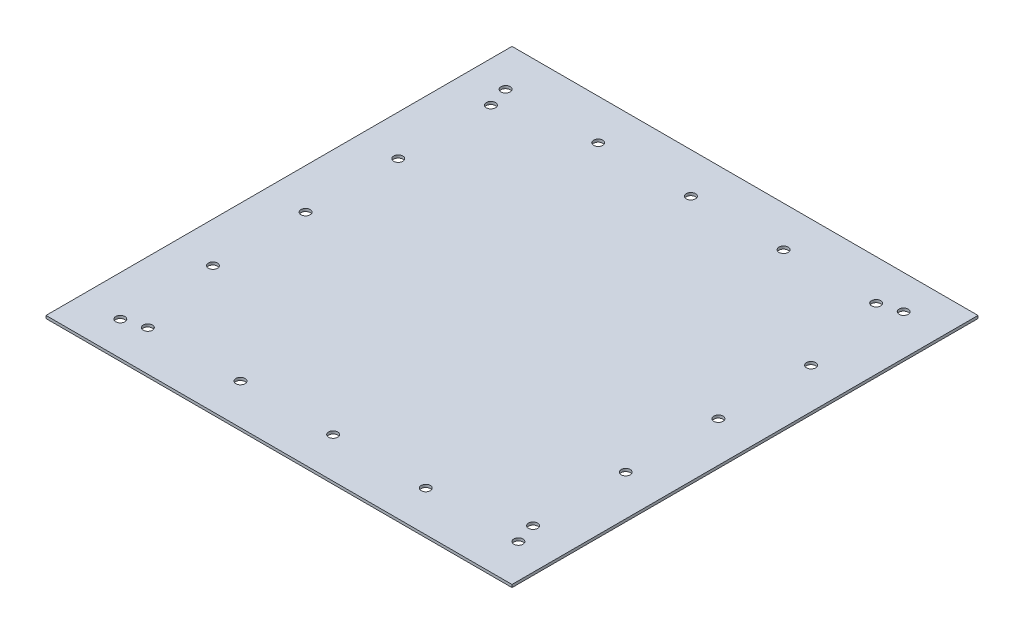
ISO-10303-21;
HEADER;
FILE_DESCRIPTION(('STEP AP214'),'2;1');
FILE_NAME('part.step','',(''),(''),'','','');
FILE_SCHEMA(('AUTOMOTIVE_DESIGN { 1 0 10303 214 1 1 1 1 }'));
ENDSEC;
DATA;
#1=APPLICATION_CONTEXT('core data for automotive mechanical design processes');
#2=APPLICATION_PROTOCOL_DEFINITION('international standard','automotive_design',2000,#1);
#3=PRODUCT_CONTEXT('',#1,'mechanical');
#4=PRODUCT('Part','Part','',(#3));
#5=PRODUCT_RELATED_PRODUCT_CATEGORY('part','',(#4));
#6=PRODUCT_DEFINITION_FORMATION('','',#4);
#7=PRODUCT_DEFINITION_CONTEXT('part definition',#1,'design');
#8=PRODUCT_DEFINITION('design','',#6,#7);
#9=PRODUCT_DEFINITION_SHAPE('','',#8);
#10=(LENGTH_UNIT() NAMED_UNIT(*) SI_UNIT(.MILLI.,.METRE.));
#11=(NAMED_UNIT(*) PLANE_ANGLE_UNIT() SI_UNIT($,.RADIAN.));
#12=(NAMED_UNIT(*) SI_UNIT($,.STERADIAN.) SOLID_ANGLE_UNIT());
#13=UNCERTAINTY_MEASURE_WITH_UNIT(LENGTH_MEASURE(1.E-05),#10,'distance_accuracy_value','');
#14=(GEOMETRIC_REPRESENTATION_CONTEXT(3) GLOBAL_UNCERTAINTY_ASSIGNED_CONTEXT((#13)) GLOBAL_UNIT_ASSIGNED_CONTEXT((#10,
#11,#12)) REPRESENTATION_CONTEXT('',''));
#15=CARTESIAN_POINT('',(0.,0.,0.));
#16=DIRECTION('',(0.,0.,1.));
#17=DIRECTION('',(1.,0.,0.));
#18=AXIS2_PLACEMENT_3D('',#15,#16,#17);
#19=CARTESIAN_POINT('',(254.,3.,254.));
#20=DIRECTION('',(-1.,0.,0.));
#21=DIRECTION('',(0.,0.,1.));
#22=AXIS2_PLACEMENT_3D('',#19,#20,#21);
#23=PLANE('',#22);
#24=DIRECTION('',(0.,0.,-1.));
#25=VECTOR('',#24,1.);
#26=CARTESIAN_POINT('',(254.,0.,254.));
#27=LINE('',#26,#25);
#28=CARTESIAN_POINT('',(254.,0.,254.));
#29=VERTEX_POINT('',#28);
#30=CARTESIAN_POINT('',(254.,0.,-254.));
#31=VERTEX_POINT('',#30);
#32=EDGE_CURVE('E109',#29,#31,#27,.T.);
#33=ORIENTED_EDGE('',*,*,#32,.T.);
#34=DIRECTION('',(0.,-1.,0.));
#35=VECTOR('',#34,1.);
#36=CARTESIAN_POINT('',(254.,3.,-254.));
#37=LINE('',#36,#35);
#38=CARTESIAN_POINT('',(254.,3.,-254.));
#39=VERTEX_POINT('',#38);
#40=EDGE_CURVE('E11',#39,#31,#37,.T.);
#41=ORIENTED_EDGE('',*,*,#40,.F.);
#42=DIRECTION('',(0.,0.,-1.));
#43=VECTOR('',#42,1.);
#44=CARTESIAN_POINT('',(254.,3.,254.));
#45=LINE('',#44,#43);
#46=CARTESIAN_POINT('',(254.,3.,254.));
#47=VERTEX_POINT('',#46);
#48=EDGE_CURVE('E92',#47,#39,#45,.T.);
#49=ORIENTED_EDGE('',*,*,#48,.F.);
#50=DIRECTION('',(0.,-1.,0.));
#51=VECTOR('',#50,1.);
#52=CARTESIAN_POINT('',(254.,3.,254.));
#53=LINE('',#52,#51);
#54=EDGE_CURVE('E105',#47,#29,#53,.T.);
#55=ORIENTED_EDGE('',*,*,#54,.T.);
#56=EDGE_LOOP('',(#33,#41,#49,#55));
#57=FACE_BOUND('',#56,.T.);
#58=ADVANCED_FACE('F39',(#57),#23,.F.);
#59=CARTESIAN_POINT('',(-254.,3.,-254.));
#60=DIRECTION('',(0.,0.,1.));
#61=DIRECTION('',(1.,0.,0.));
#62=AXIS2_PLACEMENT_3D('',#59,#60,#61);
#63=PLANE('',#62);
#64=DIRECTION('',(-1.,0.,0.));
#65=VECTOR('',#64,1.);
#66=CARTESIAN_POINT('',(-254.,0.,-254.));
#67=LINE('',#66,#65);
#68=CARTESIAN_POINT('',(-254.,0.,-254.));
#69=VERTEX_POINT('',#68);
#70=EDGE_CURVE('E97',#31,#69,#67,.T.);
#71=ORIENTED_EDGE('',*,*,#70,.T.);
#72=DIRECTION('',(0.,-1.,0.));
#73=VECTOR('',#72,1.);
#74=CARTESIAN_POINT('',(-254.,3.,-254.));
#75=LINE('',#74,#73);
#76=CARTESIAN_POINT('',(-254.,3.,-254.));
#77=VERTEX_POINT('',#76);
#78=EDGE_CURVE('E47',#77,#69,#75,.T.);
#79=ORIENTED_EDGE('',*,*,#78,.F.);
#80=DIRECTION('',(-1.,0.,0.));
#81=VECTOR('',#80,1.);
#82=CARTESIAN_POINT('',(-254.,3.,-254.));
#83=LINE('',#82,#81);
#84=EDGE_CURVE('E86',#39,#77,#83,.T.);
#85=ORIENTED_EDGE('',*,*,#84,.F.);
#86=ORIENTED_EDGE('',*,*,#40,.T.);
#87=EDGE_LOOP('',(#71,#79,#85,#86));
#88=FACE_BOUND('',#87,.T.);
#89=ADVANCED_FACE('F96',(#88),#63,.F.);
#90=CARTESIAN_POINT('',(-254.,3.,254.));
#91=DIRECTION('',(1.,0.,0.));
#92=DIRECTION('',(0.,0.,-1.));
#93=AXIS2_PLACEMENT_3D('',#90,#91,#92);
#94=PLANE('',#93);
#95=DIRECTION('',(0.,0.,1.));
#96=VECTOR('',#95,1.);
#97=CARTESIAN_POINT('',(-254.,0.,254.));
#98=LINE('',#97,#96);
#99=CARTESIAN_POINT('',(-254.,0.,254.));
#100=VERTEX_POINT('',#99);
#101=EDGE_CURVE('E73',#69,#100,#98,.T.);
#102=ORIENTED_EDGE('',*,*,#101,.T.);
#103=DIRECTION('',(0.,-1.,0.));
#104=VECTOR('',#103,1.);
#105=CARTESIAN_POINT('',(-254.,3.,254.));
#106=LINE('',#105,#104);
#107=CARTESIAN_POINT('',(-254.,3.,254.));
#108=VERTEX_POINT('',#107);
#109=EDGE_CURVE('E99',#108,#100,#106,.T.);
#110=ORIENTED_EDGE('',*,*,#109,.F.);
#111=DIRECTION('',(0.,0.,1.));
#112=VECTOR('',#111,1.);
#113=CARTESIAN_POINT('',(-254.,3.,254.));
#114=LINE('',#113,#112);
#115=EDGE_CURVE('E90',#77,#108,#114,.T.);
#116=ORIENTED_EDGE('',*,*,#115,.F.);
#117=ORIENTED_EDGE('',*,*,#78,.T.);
#118=EDGE_LOOP('',(#102,#110,#116,#117));
#119=FACE_BOUND('',#118,.T.);
#120=ADVANCED_FACE('F100',(#119),#94,.F.);
#121=CARTESIAN_POINT('',(-254.,3.,254.));
#122=DIRECTION('',(0.,0.,-1.));
#123=DIRECTION('',(-1.,0.,0.));
#124=AXIS2_PLACEMENT_3D('',#121,#122,#123);
#125=PLANE('',#124);
#126=DIRECTION('',(1.,0.,0.));
#127=VECTOR('',#126,1.);
#128=CARTESIAN_POINT('',(-254.,0.,254.));
#129=LINE('',#128,#127);
#130=EDGE_CURVE('E79',#100,#29,#129,.T.);
#131=ORIENTED_EDGE('',*,*,#130,.T.);
#132=ORIENTED_EDGE('',*,*,#54,.F.);
#133=DIRECTION('',(1.,0.,0.));
#134=VECTOR('',#133,1.);
#135=CARTESIAN_POINT('',(-254.,3.,254.));
#136=LINE('',#135,#134);
#137=EDGE_CURVE('E55',#108,#47,#136,.T.);
#138=ORIENTED_EDGE('',*,*,#137,.F.);
#139=ORIENTED_EDGE('',*,*,#109,.T.);
#140=EDGE_LOOP('',(#131,#132,#138,#139));
#141=FACE_BOUND('',#140,.T.);
#142=ADVANCED_FACE('F120',(#141),#125,.F.);
#143=CARTESIAN_POINT('',(0.,3.,0.));
#144=DIRECTION('',(0.,-1.,0.));
#145=DIRECTION('',(0.,0.,-1.));
#146=AXIS2_PLACEMENT_3D('',#143,#144,#145);
#147=PLANE('',#146);
#148=CARTESIAN_POINT('',(-209.999999999997,3.,-86.0000000000001));
#149=DIRECTION('',(0.,-1.,0.));
#150=DIRECTION('',(0.,0.,-1.));
#151=AXIS2_PLACEMENT_3D('',#148,#149,#150);
#152=CIRCLE('',#151,4.99999999999999);
#153=CARTESIAN_POINT('',(-209.999999999997,3.,-91.0000000000001));
#154=VERTEX_POINT('',#153);
#155=EDGE_CURVE('E178',#154,#154,#152,.T.);
#156=ORIENTED_EDGE('',*,*,#155,.T.);
#157=EDGE_LOOP('',(#156));
#158=FACE_BOUND('',#157,.T.);
#159=CARTESIAN_POINT('',(-209.999999999996,3.,-187.));
#160=DIRECTION('',(0.,-1.,0.));
#161=DIRECTION('',(0.,0.,-1.));
#162=AXIS2_PLACEMENT_3D('',#159,#160,#161);
#163=CIRCLE('',#162,4.99999999999999);
#164=CARTESIAN_POINT('',(-209.999999999996,3.,-192.));
#165=VERTEX_POINT('',#164);
#166=EDGE_CURVE('E206',#165,#165,#163,.T.);
#167=ORIENTED_EDGE('',*,*,#166,.T.);
#168=EDGE_LOOP('',(#167));
#169=FACE_BOUND('',#168,.T.);
#170=CARTESIAN_POINT('',(210.,3.,-217.));
#171=DIRECTION('',(0.,-1.,0.));
#172=DIRECTION('',(0.,0.,-1.));
#173=AXIS2_PLACEMENT_3D('',#170,#171,#172);
#174=CIRCLE('',#173,4.99999999999999);
#175=CARTESIAN_POINT('',(210.,3.,-222.));
#176=VERTEX_POINT('',#175);
#177=EDGE_CURVE('E199',#176,#176,#174,.T.);
#178=ORIENTED_EDGE('',*,*,#177,.T.);
#179=EDGE_LOOP('',(#178));
#180=FACE_BOUND('',#179,.T.);
#181=CARTESIAN_POINT('',(-116.,3.,-210.));
#182=DIRECTION('',(0.,-1.,0.));
#183=DIRECTION('',(0.,0.,-1.));
#184=AXIS2_PLACEMENT_3D('',#181,#182,#183);
#185=CIRCLE('',#184,4.99999999999999);
#186=CARTESIAN_POINT('',(-116.,3.,-215.));
#187=VERTEX_POINT('',#186);
#188=EDGE_CURVE('E192',#187,#187,#185,.T.);
#189=ORIENTED_EDGE('',*,*,#188,.T.);
#190=EDGE_LOOP('',(#189));
#191=FACE_BOUND('',#190,.T.);
#192=CARTESIAN_POINT('',(-15.,3.,-210.));
#193=DIRECTION('',(0.,-1.,0.));
#194=DIRECTION('',(0.,0.,-1.));
#195=AXIS2_PLACEMENT_3D('',#192,#193,#194);
#196=CIRCLE('',#195,4.99999999999999);
#197=CARTESIAN_POINT('',(-15.,3.,-215.));
#198=VERTEX_POINT('',#197);
#199=EDGE_CURVE('E193',#198,#198,#196,.T.);
#200=ORIENTED_EDGE('',*,*,#199,.T.);
#201=EDGE_LOOP('',(#200));
#202=FACE_BOUND('',#201,.T.);
#203=CARTESIAN_POINT('',(86.0000000000001,3.,-210.));
#204=DIRECTION('',(0.,-1.,0.));
#205=DIRECTION('',(0.,0.,-1.));
#206=AXIS2_PLACEMENT_3D('',#203,#204,#205);
#207=CIRCLE('',#206,4.99999999999999);
#208=CARTESIAN_POINT('',(86.0000000000001,3.,-215.));
#209=VERTEX_POINT('',#208);
#210=EDGE_CURVE('E235',#209,#209,#207,.T.);
#211=ORIENTED_EDGE('',*,*,#210,.T.);
#212=EDGE_LOOP('',(#211));
#213=FACE_BOUND('',#212,.T.);
#214=CARTESIAN_POINT('',(187.,3.,-210.));
#215=DIRECTION('',(0.,-1.,0.));
#216=DIRECTION('',(0.,0.,-1.));
#217=AXIS2_PLACEMENT_3D('',#214,#215,#216);
#218=CIRCLE('',#217,4.99999999999999);
#219=CARTESIAN_POINT('',(187.,3.,-215.));
#220=VERTEX_POINT('',#219);
#221=EDGE_CURVE('E229',#220,#220,#218,.T.);
#222=ORIENTED_EDGE('',*,*,#221,.T.);
#223=EDGE_LOOP('',(#222));
#224=FACE_BOUND('',#223,.T.);
#225=CARTESIAN_POINT('',(210.,3.,-116.));
#226=DIRECTION('',(0.,-1.,0.));
#227=DIRECTION('',(0.,0.,-1.));
#228=AXIS2_PLACEMENT_3D('',#225,#226,#227);
#229=CIRCLE('',#228,4.99999999999999);
#230=CARTESIAN_POINT('',(210.,3.,-121.));
#231=VERTEX_POINT('',#230);
#232=EDGE_CURVE('E221',#231,#231,#229,.T.);
#233=ORIENTED_EDGE('',*,*,#232,.T.);
#234=EDGE_LOOP('',(#233));
#235=FACE_BOUND('',#234,.T.);
#236=CARTESIAN_POINT('',(-86.0000000000001,3.,209.999999999998));
#237=DIRECTION('',(0.,-1.,0.));
#238=DIRECTION('',(0.,0.,-1.));
#239=AXIS2_PLACEMENT_3D('',#236,#237,#238);
#240=CIRCLE('',#239,4.99999999999999);
#241=CARTESIAN_POINT('',(-86.0000000000001,3.,204.999999999998));
#242=VERTEX_POINT('',#241);
#243=EDGE_CURVE('E149',#242,#242,#240,.T.);
#244=ORIENTED_EDGE('',*,*,#243,.T.);
#245=EDGE_LOOP('',(#244));
#246=FACE_BOUND('',#245,.T.);
#247=CARTESIAN_POINT('',(15.,3.,209.999999999999));
#248=DIRECTION('',(0.,-1.,0.));
#249=DIRECTION('',(0.,0.,-1.));
#250=AXIS2_PLACEMENT_3D('',#247,#248,#249);
#251=CIRCLE('',#250,4.99999999999999);
#252=CARTESIAN_POINT('',(15.,3.,204.999999999999));
#253=VERTEX_POINT('',#252);
#254=EDGE_CURVE('E138',#253,#253,#251,.T.);
#255=ORIENTED_EDGE('',*,*,#254,.T.);
#256=EDGE_LOOP('',(#255));
#257=FACE_BOUND('',#256,.T.);
#258=CARTESIAN_POINT('',(116.,3.,209.999999999999));
#259=DIRECTION('',(0.,-1.,0.));
#260=DIRECTION('',(0.,0.,-1.));
#261=AXIS2_PLACEMENT_3D('',#258,#259,#260);
#262=CIRCLE('',#261,4.99999999999999);
#263=CARTESIAN_POINT('',(116.,3.,204.999999999999));
#264=VERTEX_POINT('',#263);
#265=EDGE_CURVE('E137',#264,#264,#262,.T.);
#266=ORIENTED_EDGE('',*,*,#265,.T.);
#267=EDGE_LOOP('',(#266));
#268=FACE_BOUND('',#267,.T.);
#269=CARTESIAN_POINT('',(-210.,3.,217.));
#270=DIRECTION('',(0.,-1.,0.));
#271=DIRECTION('',(0.,0.,-1.));
#272=AXIS2_PLACEMENT_3D('',#269,#270,#271);
#273=CIRCLE('',#272,4.99999999999999);
#274=CARTESIAN_POINT('',(-210.,3.,212.));
#275=VERTEX_POINT('',#274);
#276=EDGE_CURVE('E131',#275,#275,#273,.T.);
#277=ORIENTED_EDGE('',*,*,#276,.T.);
#278=EDGE_LOOP('',(#277));
#279=FACE_BOUND('',#278,.T.);
#280=CARTESIAN_POINT('',(-209.999999999998,3.,15.));
#281=DIRECTION('',(0.,-1.,0.));
#282=DIRECTION('',(0.,0.,-1.));
#283=AXIS2_PLACEMENT_3D('',#280,#281,#282);
#284=CIRCLE('',#283,4.99999999999999);
#285=CARTESIAN_POINT('',(-209.999999999998,3.,9.99999999999997));
#286=VERTEX_POINT('',#285);
#287=EDGE_CURVE('E177',#286,#286,#284,.T.);
#288=ORIENTED_EDGE('',*,*,#287,.T.);
#289=EDGE_LOOP('',(#288));
#290=FACE_BOUND('',#289,.T.);
#291=CARTESIAN_POINT('',(-209.999999999999,3.,116.));
#292=DIRECTION('',(0.,-1.,0.));
#293=DIRECTION('',(0.,0.,-1.));
#294=AXIS2_PLACEMENT_3D('',#291,#292,#293);
#295=CIRCLE('',#294,4.99999999999999);
#296=CARTESIAN_POINT('',(-209.999999999999,3.,111.));
#297=VERTEX_POINT('',#296);
#298=EDGE_CURVE('E165',#297,#297,#295,.T.);
#299=ORIENTED_EDGE('',*,*,#298,.T.);
#300=EDGE_LOOP('',(#299));
#301=FACE_BOUND('',#300,.T.);
#302=CARTESIAN_POINT('',(-217.,3.,-210.));
#303=DIRECTION('',(0.,-1.,0.));
#304=DIRECTION('',(0.,0.,-1.));
#305=AXIS2_PLACEMENT_3D('',#302,#303,#304);
#306=CIRCLE('',#305,4.99999999999999);
#307=CARTESIAN_POINT('',(-217.,3.,-215.));
#308=VERTEX_POINT('',#307);
#309=EDGE_CURVE('E164',#308,#308,#306,.T.);
#310=ORIENTED_EDGE('',*,*,#309,.T.);
#311=EDGE_LOOP('',(#310));
#312=FACE_BOUND('',#311,.T.);
#313=CARTESIAN_POINT('',(-187.,3.,209.999999999997));
#314=DIRECTION('',(0.,-1.,0.));
#315=DIRECTION('',(0.,0.,-1.));
#316=AXIS2_PLACEMENT_3D('',#313,#314,#315);
#317=CIRCLE('',#316,4.99999999999999);
#318=CARTESIAN_POINT('',(-187.,3.,204.999999999997));
#319=VERTEX_POINT('',#318);
#320=EDGE_CURVE('E150',#319,#319,#317,.T.);
#321=ORIENTED_EDGE('',*,*,#320,.T.);
#322=EDGE_LOOP('',(#321));
#323=FACE_BOUND('',#322,.T.);
#324=CARTESIAN_POINT('',(209.999999999999,3.,-15.));
#325=DIRECTION('',(0.,-1.,0.));
#326=DIRECTION('',(0.,0.,-1.));
#327=AXIS2_PLACEMENT_3D('',#324,#325,#326);
#328=CIRCLE('',#327,4.99999999999999);
#329=CARTESIAN_POINT('',(209.999999999999,3.,-19.9999999999999));
#330=VERTEX_POINT('',#329);
#331=EDGE_CURVE('E222',#330,#330,#328,.T.);
#332=ORIENTED_EDGE('',*,*,#331,.T.);
#333=EDGE_LOOP('',(#332));
#334=FACE_BOUND('',#333,.T.);
#335=CARTESIAN_POINT('',(209.999999999999,3.,86.0000000000001));
#336=DIRECTION('',(0.,-1.,0.));
#337=DIRECTION('',(0.,0.,-1.));
#338=AXIS2_PLACEMENT_3D('',#335,#336,#337);
#339=CIRCLE('',#338,4.99999999999999);
#340=CARTESIAN_POINT('',(209.999999999999,3.,81.0000000000001));
#341=VERTEX_POINT('',#340);
#342=EDGE_CURVE('E254',#341,#341,#339,.T.);
#343=ORIENTED_EDGE('',*,*,#342,.T.);
#344=EDGE_LOOP('',(#343));
#345=FACE_BOUND('',#344,.T.);
#346=CARTESIAN_POINT('',(209.999999999999,3.,187.));
#347=DIRECTION('',(0.,-1.,0.));
#348=DIRECTION('',(0.,0.,-1.));
#349=AXIS2_PLACEMENT_3D('',#346,#347,#348);
#350=CIRCLE('',#349,4.99999999999999);
#351=CARTESIAN_POINT('',(209.999999999999,3.,182.));
#352=VERTEX_POINT('',#351);
#353=EDGE_CURVE('E246',#352,#352,#350,.T.);
#354=ORIENTED_EDGE('',*,*,#353,.T.);
#355=EDGE_LOOP('',(#354));
#356=FACE_BOUND('',#355,.T.);
#357=CARTESIAN_POINT('',(217.,3.,210.));
#358=DIRECTION('',(0.,-1.,0.));
#359=DIRECTION('',(0.,0.,-1.));
#360=AXIS2_PLACEMENT_3D('',#357,#358,#359);
#361=CIRCLE('',#360,4.99999999999999);
#362=CARTESIAN_POINT('',(217.,3.,205.));
#363=VERTEX_POINT('',#362);
#364=EDGE_CURVE('E113',#363,#363,#361,.T.);
#365=ORIENTED_EDGE('',*,*,#364,.T.);
#366=EDGE_LOOP('',(#365));
#367=FACE_BOUND('',#366,.T.);
#368=ORIENTED_EDGE('',*,*,#48,.T.);
#369=ORIENTED_EDGE('',*,*,#84,.T.);
#370=ORIENTED_EDGE('',*,*,#115,.T.);
#371=ORIENTED_EDGE('',*,*,#137,.T.);
#372=EDGE_LOOP('',(#368,#369,#370,#371));
#373=FACE_BOUND('',#372,.T.);
#374=ADVANCED_FACE('F88',(#158,#169,#180,#191,#202,#213,#224,#235,#246,#257,#268,#279,#290,#301,
#312,#323,#334,#345,#356,#367,#373),#147,.F.);
#375=CARTESIAN_POINT('',(0.,0.,0.));
#376=DIRECTION('',(0.,-1.,0.));
#377=DIRECTION('',(0.,0.,-1.));
#378=AXIS2_PLACEMENT_3D('',#375,#376,#377);
#379=PLANE('',#378);
#380=CARTESIAN_POINT('',(-209.999999999997,0.,-86.0000000000001));
#381=DIRECTION('',(0.,-1.,0.));
#382=DIRECTION('',(0.,0.,-1.));
#383=AXIS2_PLACEMENT_3D('',#380,#381,#382);
#384=CIRCLE('',#383,4.99999999999999);
#385=CARTESIAN_POINT('',(-209.999999999997,0.,-91.0000000000001));
#386=VERTEX_POINT('',#385);
#387=EDGE_CURVE('E210',#386,#386,#384,.T.);
#388=ORIENTED_EDGE('',*,*,#387,.F.);
#389=EDGE_LOOP('',(#388));
#390=FACE_BOUND('',#389,.T.);
#391=CARTESIAN_POINT('',(-209.999999999996,0.,-187.));
#392=DIRECTION('',(0.,-1.,0.));
#393=DIRECTION('',(0.,0.,-1.));
#394=AXIS2_PLACEMENT_3D('',#391,#392,#393);
#395=CIRCLE('',#394,4.99999999999999);
#396=CARTESIAN_POINT('',(-209.999999999996,0.,-192.));
#397=VERTEX_POINT('',#396);
#398=EDGE_CURVE('E202',#397,#397,#395,.T.);
#399=ORIENTED_EDGE('',*,*,#398,.F.);
#400=EDGE_LOOP('',(#399));
#401=FACE_BOUND('',#400,.T.);
#402=CARTESIAN_POINT('',(210.,0.,-217.));
#403=DIRECTION('',(0.,-1.,0.));
#404=DIRECTION('',(0.,0.,-1.));
#405=AXIS2_PLACEMENT_3D('',#402,#403,#404);
#406=CIRCLE('',#405,4.99999999999999);
#407=CARTESIAN_POINT('',(210.,0.,-222.));
#408=VERTEX_POINT('',#407);
#409=EDGE_CURVE('E196',#408,#408,#406,.T.);
#410=ORIENTED_EDGE('',*,*,#409,.F.);
#411=EDGE_LOOP('',(#410));
#412=FACE_BOUND('',#411,.T.);
#413=CARTESIAN_POINT('',(-116.,0.,-210.));
#414=DIRECTION('',(0.,-1.,0.));
#415=DIRECTION('',(0.,0.,-1.));
#416=AXIS2_PLACEMENT_3D('',#413,#414,#415);
#417=CIRCLE('',#416,4.99999999999999);
#418=CARTESIAN_POINT('',(-116.,0.,-215.));
#419=VERTEX_POINT('',#418);
#420=EDGE_CURVE('E188',#419,#419,#417,.T.);
#421=ORIENTED_EDGE('',*,*,#420,.F.);
#422=EDGE_LOOP('',(#421));
#423=FACE_BOUND('',#422,.T.);
#424=CARTESIAN_POINT('',(-15.,0.,-210.));
#425=DIRECTION('',(0.,-1.,0.));
#426=DIRECTION('',(0.,0.,-1.));
#427=AXIS2_PLACEMENT_3D('',#424,#425,#426);
#428=CIRCLE('',#427,4.99999999999999);
#429=CARTESIAN_POINT('',(-15.,0.,-215.));
#430=VERTEX_POINT('',#429);
#431=EDGE_CURVE('E238',#430,#430,#428,.T.);
#432=ORIENTED_EDGE('',*,*,#431,.F.);
#433=EDGE_LOOP('',(#432));
#434=FACE_BOUND('',#433,.T.);
#435=CARTESIAN_POINT('',(86.0000000000001,0.,-210.));
#436=DIRECTION('',(0.,-1.,0.));
#437=DIRECTION('',(0.,0.,-1.));
#438=AXIS2_PLACEMENT_3D('',#435,#436,#437);
#439=CIRCLE('',#438,4.99999999999999);
#440=CARTESIAN_POINT('',(86.0000000000001,0.,-215.));
#441=VERTEX_POINT('',#440);
#442=EDGE_CURVE('E232',#441,#441,#439,.T.);
#443=ORIENTED_EDGE('',*,*,#442,.F.);
#444=EDGE_LOOP('',(#443));
#445=FACE_BOUND('',#444,.T.);
#446=CARTESIAN_POINT('',(187.,0.,-210.));
#447=DIRECTION('',(0.,-1.,0.));
#448=DIRECTION('',(0.,0.,-1.));
#449=AXIS2_PLACEMENT_3D('',#446,#447,#448);
#450=CIRCLE('',#449,4.99999999999999);
#451=CARTESIAN_POINT('',(187.,0.,-215.));
#452=VERTEX_POINT('',#451);
#453=EDGE_CURVE('E226',#452,#452,#450,.T.);
#454=ORIENTED_EDGE('',*,*,#453,.F.);
#455=EDGE_LOOP('',(#454));
#456=FACE_BOUND('',#455,.T.);
#457=CARTESIAN_POINT('',(210.,0.,-116.));
#458=DIRECTION('',(0.,-1.,0.));
#459=DIRECTION('',(0.,0.,-1.));
#460=AXIS2_PLACEMENT_3D('',#457,#458,#459);
#461=CIRCLE('',#460,4.99999999999999);
#462=CARTESIAN_POINT('',(210.,0.,-121.));
#463=VERTEX_POINT('',#462);
#464=EDGE_CURVE('E217',#463,#463,#461,.T.);
#465=ORIENTED_EDGE('',*,*,#464,.F.);
#466=EDGE_LOOP('',(#465));
#467=FACE_BOUND('',#466,.T.);
#468=CARTESIAN_POINT('',(-86.0000000000001,0.,209.999999999998));
#469=DIRECTION('',(0.,-1.,0.));
#470=DIRECTION('',(0.,0.,-1.));
#471=AXIS2_PLACEMENT_3D('',#468,#469,#470);
#472=CIRCLE('',#471,4.99999999999999);
#473=CARTESIAN_POINT('',(-86.0000000000001,0.,204.999999999998));
#474=VERTEX_POINT('',#473);
#475=EDGE_CURVE('E146',#474,#474,#472,.T.);
#476=ORIENTED_EDGE('',*,*,#475,.F.);
#477=EDGE_LOOP('',(#476));
#478=FACE_BOUND('',#477,.T.);
#479=CARTESIAN_POINT('',(15.,0.,209.999999999999));
#480=DIRECTION('',(0.,-1.,0.));
#481=DIRECTION('',(0.,0.,-1.));
#482=AXIS2_PLACEMENT_3D('',#479,#480,#481);
#483=CIRCLE('',#482,4.99999999999999);
#484=CARTESIAN_POINT('',(15.,0.,204.999999999999));
#485=VERTEX_POINT('',#484);
#486=EDGE_CURVE('E153',#485,#485,#483,.T.);
#487=ORIENTED_EDGE('',*,*,#486,.F.);
#488=EDGE_LOOP('',(#487));
#489=FACE_BOUND('',#488,.T.);
#490=CARTESIAN_POINT('',(116.,0.,209.999999999999));
#491=DIRECTION('',(0.,-1.,0.));
#492=DIRECTION('',(0.,0.,-1.));
#493=AXIS2_PLACEMENT_3D('',#490,#491,#492);
#494=CIRCLE('',#493,4.99999999999999);
#495=CARTESIAN_POINT('',(116.,0.,204.999999999999));
#496=VERTEX_POINT('',#495);
#497=EDGE_CURVE('E134',#496,#496,#494,.T.);
#498=ORIENTED_EDGE('',*,*,#497,.F.);
#499=EDGE_LOOP('',(#498));
#500=FACE_BOUND('',#499,.T.);
#501=CARTESIAN_POINT('',(-210.,0.,217.));
#502=DIRECTION('',(0.,-1.,0.));
#503=DIRECTION('',(0.,0.,-1.));
#504=AXIS2_PLACEMENT_3D('',#501,#502,#503);
#505=CIRCLE('',#504,4.99999999999999);
#506=CARTESIAN_POINT('',(-210.,0.,212.));
#507=VERTEX_POINT('',#506);
#508=EDGE_CURVE('E141',#507,#507,#505,.T.);
#509=ORIENTED_EDGE('',*,*,#508,.F.);
#510=EDGE_LOOP('',(#509));
#511=FACE_BOUND('',#510,.T.);
#512=CARTESIAN_POINT('',(-209.999999999998,0.,15.));
#513=DIRECTION('',(0.,-1.,0.));
#514=DIRECTION('',(0.,0.,-1.));
#515=AXIS2_PLACEMENT_3D('',#512,#513,#514);
#516=CIRCLE('',#515,4.99999999999999);
#517=CARTESIAN_POINT('',(-209.999999999998,0.,9.99999999999997));
#518=VERTEX_POINT('',#517);
#519=EDGE_CURVE('E174',#518,#518,#516,.T.);
#520=ORIENTED_EDGE('',*,*,#519,.F.);
#521=EDGE_LOOP('',(#520));
#522=FACE_BOUND('',#521,.T.);
#523=CARTESIAN_POINT('',(-209.999999999999,0.,116.));
#524=DIRECTION('',(0.,-1.,0.));
#525=DIRECTION('',(0.,0.,-1.));
#526=AXIS2_PLACEMENT_3D('',#523,#524,#525);
#527=CIRCLE('',#526,4.99999999999999);
#528=CARTESIAN_POINT('',(-209.999999999999,0.,111.));
#529=VERTEX_POINT('',#528);
#530=EDGE_CURVE('E181',#529,#529,#527,.T.);
#531=ORIENTED_EDGE('',*,*,#530,.F.);
#532=EDGE_LOOP('',(#531));
#533=FACE_BOUND('',#532,.T.);
#534=CARTESIAN_POINT('',(-217.,0.,-210.));
#535=DIRECTION('',(0.,-1.,0.));
#536=DIRECTION('',(0.,0.,-1.));
#537=AXIS2_PLACEMENT_3D('',#534,#535,#536);
#538=CIRCLE('',#537,4.99999999999999);
#539=CARTESIAN_POINT('',(-217.,0.,-215.));
#540=VERTEX_POINT('',#539);
#541=EDGE_CURVE('E160',#540,#540,#538,.T.);
#542=ORIENTED_EDGE('',*,*,#541,.F.);
#543=EDGE_LOOP('',(#542));
#544=FACE_BOUND('',#543,.T.);
#545=CARTESIAN_POINT('',(-187.,0.,209.999999999997));
#546=DIRECTION('',(0.,-1.,0.));
#547=DIRECTION('',(0.,0.,-1.));
#548=AXIS2_PLACEMENT_3D('',#545,#546,#547);
#549=CIRCLE('',#548,4.99999999999999);
#550=CARTESIAN_POINT('',(-187.,0.,204.999999999997));
#551=VERTEX_POINT('',#550);
#552=EDGE_CURVE('E169',#551,#551,#549,.T.);
#553=ORIENTED_EDGE('',*,*,#552,.F.);
#554=EDGE_LOOP('',(#553));
#555=FACE_BOUND('',#554,.T.);
#556=CARTESIAN_POINT('',(209.999999999999,0.,-15.));
#557=DIRECTION('',(0.,-1.,0.));
#558=DIRECTION('',(0.,0.,-1.));
#559=AXIS2_PLACEMENT_3D('',#556,#557,#558);
#560=CIRCLE('',#559,4.99999999999999);
#561=CARTESIAN_POINT('',(209.999999999999,0.,-19.9999999999999));
#562=VERTEX_POINT('',#561);
#563=EDGE_CURVE('E258',#562,#562,#560,.T.);
#564=ORIENTED_EDGE('',*,*,#563,.F.);
#565=EDGE_LOOP('',(#564));
#566=FACE_BOUND('',#565,.T.);
#567=CARTESIAN_POINT('',(209.999999999999,0.,86.0000000000001));
#568=DIRECTION('',(0.,-1.,0.));
#569=DIRECTION('',(0.,0.,-1.));
#570=AXIS2_PLACEMENT_3D('',#567,#568,#569);
#571=CIRCLE('',#570,4.99999999999999);
#572=CARTESIAN_POINT('',(209.999999999999,0.,81.0000000000001));
#573=VERTEX_POINT('',#572);
#574=EDGE_CURVE('E250',#573,#573,#571,.T.);
#575=ORIENTED_EDGE('',*,*,#574,.F.);
#576=EDGE_LOOP('',(#575));
#577=FACE_BOUND('',#576,.T.);
#578=CARTESIAN_POINT('',(209.999999999999,0.,187.));
#579=DIRECTION('',(0.,-1.,0.));
#580=DIRECTION('',(0.,0.,-1.));
#581=AXIS2_PLACEMENT_3D('',#578,#579,#580);
#582=CIRCLE('',#581,4.99999999999999);
#583=CARTESIAN_POINT('',(209.999999999999,0.,182.));
#584=VERTEX_POINT('',#583);
#585=EDGE_CURVE('E243',#584,#584,#582,.T.);
#586=ORIENTED_EDGE('',*,*,#585,.F.);
#587=EDGE_LOOP('',(#586));
#588=FACE_BOUND('',#587,.T.);
#589=CARTESIAN_POINT('',(217.,0.,210.));
#590=DIRECTION('',(0.,-1.,0.));
#591=DIRECTION('',(0.,0.,-1.));
#592=AXIS2_PLACEMENT_3D('',#589,#590,#591);
#593=CIRCLE('',#592,4.99999999999999);
#594=CARTESIAN_POINT('',(217.,0.,205.));
#595=VERTEX_POINT('',#594);
#596=EDGE_CURVE('E128',#595,#595,#593,.T.);
#597=ORIENTED_EDGE('',*,*,#596,.F.);
#598=EDGE_LOOP('',(#597));
#599=FACE_BOUND('',#598,.T.);
#600=ORIENTED_EDGE('',*,*,#32,.F.);
#601=ORIENTED_EDGE('',*,*,#130,.F.);
#602=ORIENTED_EDGE('',*,*,#101,.F.);
#603=ORIENTED_EDGE('',*,*,#70,.F.);
#604=EDGE_LOOP('',(#600,#601,#602,#603));
#605=FACE_BOUND('',#604,.T.);
#606=ADVANCED_FACE('F123',(#390,#401,#412,#423,#434,#445,#456,#467,#478,#489,#500,#511,#522,
#533,#544,#555,#566,#577,#588,#599,#605),#379,.T.);
#607=CARTESIAN_POINT('',(217.,3.,210.));
#608=DIRECTION('',(0.,-1.,0.));
#609=DIRECTION('',(0.,0.,-1.));
#610=AXIS2_PLACEMENT_3D('',#607,#608,#609);
#611=CYLINDRICAL_SURFACE('',#610,4.99999999999999);
#612=ORIENTED_EDGE('',*,*,#364,.F.);
#613=EDGE_LOOP('',(#612));
#614=FACE_BOUND('',#613,.T.);
#615=ORIENTED_EDGE('',*,*,#596,.T.);
#616=EDGE_LOOP('',(#615));
#617=FACE_BOUND('',#616,.T.);
#618=ADVANCED_FACE('F277',(#614,#617),#611,.F.);
#619=CARTESIAN_POINT('',(209.999999999999,3.,187.));
#620=DIRECTION('',(0.,-1.,0.));
#621=DIRECTION('',(0.,0.,-1.));
#622=AXIS2_PLACEMENT_3D('',#619,#620,#621);
#623=CYLINDRICAL_SURFACE('',#622,4.99999999999999);
#624=ORIENTED_EDGE('',*,*,#353,.F.);
#625=EDGE_LOOP('',(#624));
#626=FACE_BOUND('',#625,.T.);
#627=ORIENTED_EDGE('',*,*,#585,.T.);
#628=EDGE_LOOP('',(#627));
#629=FACE_BOUND('',#628,.T.);
#630=ADVANCED_FACE('F287',(#626,#629),#623,.F.);
#631=CARTESIAN_POINT('',(209.999999999999,3.,86.0000000000001));
#632=DIRECTION('',(0.,-1.,0.));
#633=DIRECTION('',(0.,0.,-1.));
#634=AXIS2_PLACEMENT_3D('',#631,#632,#633);
#635=CYLINDRICAL_SURFACE('',#634,4.99999999999999);
#636=ORIENTED_EDGE('',*,*,#342,.F.);
#637=EDGE_LOOP('',(#636));
#638=FACE_BOUND('',#637,.T.);
#639=ORIENTED_EDGE('',*,*,#574,.T.);
#640=EDGE_LOOP('',(#639));
#641=FACE_BOUND('',#640,.T.);
#642=ADVANCED_FACE('F271',(#638,#641),#635,.F.);
#643=CARTESIAN_POINT('',(209.999999999999,3.,-15.));
#644=DIRECTION('',(0.,-1.,0.));
#645=DIRECTION('',(0.,0.,-1.));
#646=AXIS2_PLACEMENT_3D('',#643,#644,#645);
#647=CYLINDRICAL_SURFACE('',#646,4.99999999999999);
#648=ORIENTED_EDGE('',*,*,#331,.F.);
#649=EDGE_LOOP('',(#648));
#650=FACE_BOUND('',#649,.T.);
#651=ORIENTED_EDGE('',*,*,#563,.T.);
#652=EDGE_LOOP('',(#651));
#653=FACE_BOUND('',#652,.T.);
#654=ADVANCED_FACE('F267',(#650,#653),#647,.F.);
#655=CARTESIAN_POINT('',(-187.,3.,209.999999999997));
#656=DIRECTION('',(0.,-1.,0.));
#657=DIRECTION('',(0.,0.,-1.));
#658=AXIS2_PLACEMENT_3D('',#655,#656,#657);
#659=CYLINDRICAL_SURFACE('',#658,4.99999999999999);
#660=ORIENTED_EDGE('',*,*,#320,.F.);
#661=EDGE_LOOP('',(#660));
#662=FACE_BOUND('',#661,.T.);
#663=ORIENTED_EDGE('',*,*,#552,.T.);
#664=EDGE_LOOP('',(#663));
#665=FACE_BOUND('',#664,.T.);
#666=ADVANCED_FACE('F270',(#662,#665),#659,.F.);
#667=CARTESIAN_POINT('',(-217.,3.,-210.));
#668=DIRECTION('',(0.,-1.,0.));
#669=DIRECTION('',(0.,0.,-1.));
#670=AXIS2_PLACEMENT_3D('',#667,#668,#669);
#671=CYLINDRICAL_SURFACE('',#670,4.99999999999999);
#672=ORIENTED_EDGE('',*,*,#309,.F.);
#673=EDGE_LOOP('',(#672));
#674=FACE_BOUND('',#673,.T.);
#675=ORIENTED_EDGE('',*,*,#541,.T.);
#676=EDGE_LOOP('',(#675));
#677=FACE_BOUND('',#676,.T.);
#678=ADVANCED_FACE('F346',(#674,#677),#671,.F.);
#679=CARTESIAN_POINT('',(-209.999999999999,3.,116.));
#680=DIRECTION('',(0.,-1.,0.));
#681=DIRECTION('',(0.,0.,-1.));
#682=AXIS2_PLACEMENT_3D('',#679,#680,#681);
#683=CYLINDRICAL_SURFACE('',#682,4.99999999999999);
#684=ORIENTED_EDGE('',*,*,#298,.F.);
#685=EDGE_LOOP('',(#684));
#686=FACE_BOUND('',#685,.T.);
#687=ORIENTED_EDGE('',*,*,#530,.T.);
#688=EDGE_LOOP('',(#687));
#689=FACE_BOUND('',#688,.T.);
#690=ADVANCED_FACE('F353',(#686,#689),#683,.F.);
#691=CARTESIAN_POINT('',(-209.999999999998,3.,15.));
#692=DIRECTION('',(0.,-1.,0.));
#693=DIRECTION('',(0.,0.,-1.));
#694=AXIS2_PLACEMENT_3D('',#691,#692,#693);
#695=CYLINDRICAL_SURFACE('',#694,4.99999999999999);
#696=ORIENTED_EDGE('',*,*,#287,.F.);
#697=EDGE_LOOP('',(#696));
#698=FACE_BOUND('',#697,.T.);
#699=ORIENTED_EDGE('',*,*,#519,.T.);
#700=EDGE_LOOP('',(#699));
#701=FACE_BOUND('',#700,.T.);
#702=ADVANCED_FACE('F357',(#698,#701),#695,.F.);
#703=CARTESIAN_POINT('',(-210.,3.,217.));
#704=DIRECTION('',(0.,-1.,0.));
#705=DIRECTION('',(0.,0.,-1.));
#706=AXIS2_PLACEMENT_3D('',#703,#704,#705);
#707=CYLINDRICAL_SURFACE('',#706,4.99999999999999);
#708=ORIENTED_EDGE('',*,*,#276,.F.);
#709=EDGE_LOOP('',(#708));
#710=FACE_BOUND('',#709,.T.);
#711=ORIENTED_EDGE('',*,*,#508,.T.);
#712=EDGE_LOOP('',(#711));
#713=FACE_BOUND('',#712,.T.);
#714=ADVANCED_FACE('F370',(#710,#713),#707,.F.);
#715=CARTESIAN_POINT('',(116.,3.,209.999999999999));
#716=DIRECTION('',(0.,-1.,0.));
#717=DIRECTION('',(0.,0.,-1.));
#718=AXIS2_PLACEMENT_3D('',#715,#716,#717);
#719=CYLINDRICAL_SURFACE('',#718,4.99999999999999);
#720=ORIENTED_EDGE('',*,*,#265,.F.);
#721=EDGE_LOOP('',(#720));
#722=FACE_BOUND('',#721,.T.);
#723=ORIENTED_EDGE('',*,*,#497,.T.);
#724=EDGE_LOOP('',(#723));
#725=FACE_BOUND('',#724,.T.);
#726=ADVANCED_FACE('F364',(#722,#725),#719,.F.);
#727=CARTESIAN_POINT('',(15.,3.,209.999999999999));
#728=DIRECTION('',(0.,-1.,0.));
#729=DIRECTION('',(0.,0.,-1.));
#730=AXIS2_PLACEMENT_3D('',#727,#728,#729);
#731=CYLINDRICAL_SURFACE('',#730,4.99999999999999);
#732=ORIENTED_EDGE('',*,*,#254,.F.);
#733=EDGE_LOOP('',(#732));
#734=FACE_BOUND('',#733,.T.);
#735=ORIENTED_EDGE('',*,*,#486,.T.);
#736=EDGE_LOOP('',(#735));
#737=FACE_BOUND('',#736,.T.);
#738=ADVANCED_FACE('F360',(#734,#737),#731,.F.);
#739=CARTESIAN_POINT('',(-86.0000000000001,3.,209.999999999998));
#740=DIRECTION('',(0.,-1.,0.));
#741=DIRECTION('',(0.,0.,-1.));
#742=AXIS2_PLACEMENT_3D('',#739,#740,#741);
#743=CYLINDRICAL_SURFACE('',#742,4.99999999999999);
#744=ORIENTED_EDGE('',*,*,#243,.F.);
#745=EDGE_LOOP('',(#744));
#746=FACE_BOUND('',#745,.T.);
#747=ORIENTED_EDGE('',*,*,#475,.T.);
#748=EDGE_LOOP('',(#747));
#749=FACE_BOUND('',#748,.T.);
#750=ADVANCED_FACE('F363',(#746,#749),#743,.F.);
#751=CARTESIAN_POINT('',(210.,3.,-116.));
#752=DIRECTION('',(0.,-1.,0.));
#753=DIRECTION('',(0.,0.,-1.));
#754=AXIS2_PLACEMENT_3D('',#751,#752,#753);
#755=CYLINDRICAL_SURFACE('',#754,4.99999999999999);
#756=ORIENTED_EDGE('',*,*,#232,.F.);
#757=EDGE_LOOP('',(#756));
#758=FACE_BOUND('',#757,.T.);
#759=ORIENTED_EDGE('',*,*,#464,.T.);
#760=EDGE_LOOP('',(#759));
#761=FACE_BOUND('',#760,.T.);
#762=ADVANCED_FACE('F368',(#758,#761),#755,.F.);
#763=CARTESIAN_POINT('',(187.,3.,-210.));
#764=DIRECTION('',(0.,-1.,0.));
#765=DIRECTION('',(0.,0.,-1.));
#766=AXIS2_PLACEMENT_3D('',#763,#764,#765);
#767=CYLINDRICAL_SURFACE('',#766,4.99999999999999);
#768=ORIENTED_EDGE('',*,*,#221,.F.);
#769=EDGE_LOOP('',(#768));
#770=FACE_BOUND('',#769,.T.);
#771=ORIENTED_EDGE('',*,*,#453,.T.);
#772=EDGE_LOOP('',(#771));
#773=FACE_BOUND('',#772,.T.);
#774=ADVANCED_FACE('F416',(#770,#773),#767,.F.);
#775=CARTESIAN_POINT('',(86.0000000000001,3.,-210.));
#776=DIRECTION('',(0.,-1.,0.));
#777=DIRECTION('',(0.,0.,-1.));
#778=AXIS2_PLACEMENT_3D('',#775,#776,#777);
#779=CYLINDRICAL_SURFACE('',#778,4.99999999999999);
#780=ORIENTED_EDGE('',*,*,#210,.F.);
#781=EDGE_LOOP('',(#780));
#782=FACE_BOUND('',#781,.T.);
#783=ORIENTED_EDGE('',*,*,#442,.T.);
#784=EDGE_LOOP('',(#783));
#785=FACE_BOUND('',#784,.T.);
#786=ADVANCED_FACE('F420',(#782,#785),#779,.F.);
#787=CARTESIAN_POINT('',(-15.,3.,-210.));
#788=DIRECTION('',(0.,-1.,0.));
#789=DIRECTION('',(0.,0.,-1.));
#790=AXIS2_PLACEMENT_3D('',#787,#788,#789);
#791=CYLINDRICAL_SURFACE('',#790,4.99999999999999);
#792=ORIENTED_EDGE('',*,*,#199,.F.);
#793=EDGE_LOOP('',(#792));
#794=FACE_BOUND('',#793,.T.);
#795=ORIENTED_EDGE('',*,*,#431,.T.);
#796=EDGE_LOOP('',(#795));
#797=FACE_BOUND('',#796,.T.);
#798=ADVANCED_FACE('F401',(#794,#797),#791,.F.);
#799=CARTESIAN_POINT('',(-116.,3.,-210.));
#800=DIRECTION('',(0.,-1.,0.));
#801=DIRECTION('',(0.,0.,-1.));
#802=AXIS2_PLACEMENT_3D('',#799,#800,#801);
#803=CYLINDRICAL_SURFACE('',#802,4.99999999999999);
#804=ORIENTED_EDGE('',*,*,#188,.F.);
#805=EDGE_LOOP('',(#804));
#806=FACE_BOUND('',#805,.T.);
#807=ORIENTED_EDGE('',*,*,#420,.T.);
#808=EDGE_LOOP('',(#807));
#809=FACE_BOUND('',#808,.T.);
#810=ADVANCED_FACE('F397',(#806,#809),#803,.F.);
#811=CARTESIAN_POINT('',(210.,3.,-217.));
#812=DIRECTION('',(0.,-1.,0.));
#813=DIRECTION('',(0.,0.,-1.));
#814=AXIS2_PLACEMENT_3D('',#811,#812,#813);
#815=CYLINDRICAL_SURFACE('',#814,4.99999999999999);
#816=ORIENTED_EDGE('',*,*,#177,.F.);
#817=EDGE_LOOP('',(#816));
#818=FACE_BOUND('',#817,.T.);
#819=ORIENTED_EDGE('',*,*,#409,.T.);
#820=EDGE_LOOP('',(#819));
#821=FACE_BOUND('',#820,.T.);
#822=ADVANCED_FACE('F400',(#818,#821),#815,.F.);
#823=CARTESIAN_POINT('',(-209.999999999996,3.,-187.));
#824=DIRECTION('',(0.,-1.,0.));
#825=DIRECTION('',(0.,0.,-1.));
#826=AXIS2_PLACEMENT_3D('',#823,#824,#825);
#827=CYLINDRICAL_SURFACE('',#826,4.99999999999999);
#828=ORIENTED_EDGE('',*,*,#166,.F.);
#829=EDGE_LOOP('',(#828));
#830=FACE_BOUND('',#829,.T.);
#831=ORIENTED_EDGE('',*,*,#398,.T.);
#832=EDGE_LOOP('',(#831));
#833=FACE_BOUND('',#832,.T.);
#834=ADVANCED_FACE('F405',(#830,#833),#827,.F.);
#835=CARTESIAN_POINT('',(-209.999999999997,3.,-86.0000000000001));
#836=DIRECTION('',(0.,-1.,0.));
#837=DIRECTION('',(0.,0.,-1.));
#838=AXIS2_PLACEMENT_3D('',#835,#836,#837);
#839=CYLINDRICAL_SURFACE('',#838,4.99999999999999);
#840=ORIENTED_EDGE('',*,*,#155,.F.);
#841=EDGE_LOOP('',(#840));
#842=FACE_BOUND('',#841,.T.);
#843=ORIENTED_EDGE('',*,*,#387,.T.);
#844=EDGE_LOOP('',(#843));
#845=FACE_BOUND('',#844,.T.);
#846=ADVANCED_FACE('F409',(#842,#845),#839,.F.);
#847=CLOSED_SHELL('',(#58,#89,#120,#142,#374,#606,#618,#630,#642,#654,#666,#678,#690,#702,#714,
#726,#738,#750,#762,#774,#786,#798,#810,#822,#834,#846));
#848=MANIFOLD_SOLID_BREP('B2',#847);
#849=ADVANCED_BREP_SHAPE_REPRESENTATION('',(#18,#848),#14);
#850=SHAPE_DEFINITION_REPRESENTATION(#9,#849);
ENDSEC;
END-ISO-10303-21;
